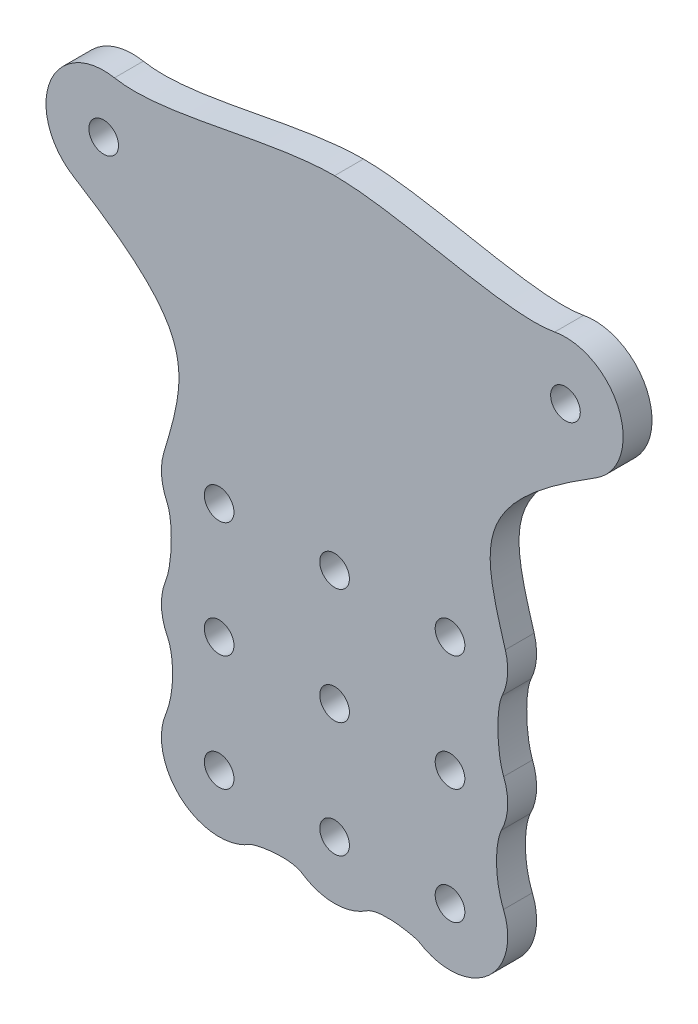
ISO-10303-21;
HEADER;
FILE_DESCRIPTION(('STEP AP214'),'2;1');
FILE_NAME('part.step','',(''),(''),'','','');
FILE_SCHEMA(('AUTOMOTIVE_DESIGN { 1 0 10303 214 1 1 1 1 }'));
ENDSEC;
DATA;
#1=APPLICATION_CONTEXT('core data for automotive mechanical design processes');
#2=APPLICATION_PROTOCOL_DEFINITION('international standard','automotive_design',2000,#1);
#3=PRODUCT_CONTEXT('',#1,'mechanical');
#4=PRODUCT('Part','Part','',(#3));
#5=PRODUCT_RELATED_PRODUCT_CATEGORY('part','',(#4));
#6=PRODUCT_DEFINITION_FORMATION('','',#4);
#7=PRODUCT_DEFINITION_CONTEXT('part definition',#1,'design');
#8=PRODUCT_DEFINITION('design','',#6,#7);
#9=PRODUCT_DEFINITION_SHAPE('','',#8);
#10=(LENGTH_UNIT() NAMED_UNIT(*) SI_UNIT(.MILLI.,.METRE.));
#11=(NAMED_UNIT(*) PLANE_ANGLE_UNIT() SI_UNIT($,.RADIAN.));
#12=(NAMED_UNIT(*) SI_UNIT($,.STERADIAN.) SOLID_ANGLE_UNIT());
#13=UNCERTAINTY_MEASURE_WITH_UNIT(LENGTH_MEASURE(1.E-05),#10,'distance_accuracy_value','');
#14=(GEOMETRIC_REPRESENTATION_CONTEXT(3) GLOBAL_UNCERTAINTY_ASSIGNED_CONTEXT((#13)) GLOBAL_UNIT_ASSIGNED_CONTEXT((#10,
#11,#12)) REPRESENTATION_CONTEXT('',''));
#15=CARTESIAN_POINT('',(0.,0.,0.));
#16=DIRECTION('',(0.,0.,1.));
#17=DIRECTION('',(1.,0.,0.));
#18=AXIS2_PLACEMENT_3D('',#15,#16,#17);
#19=CARTESIAN_POINT('',(57.4738024294832,-10.8051081036806,6.35));
#20=CARTESIAN_POINT('',(30.3242250838508,-27.5741134213604,6.35));
#21=CARTESIAN_POINT('',(32.0432983335942,-35.0407795292835,6.35));
#22=CARTESIAN_POINT('',(37.5674500564816,-53.5108848433959,6.35));
#23=B_SPLINE_CURVE_WITH_KNOTS('',3,(#19,#20,#21,#22),.UNSPECIFIED.,.F.,.F.,(4,4),(0.,1.),.UNSPECIFIED.);
#24=DIRECTION('',(0.,0.,-1.));
#25=VECTOR('',#24,1.);
#26=SURFACE_OF_LINEAR_EXTRUSION('',#23,#25);
#27=CARTESIAN_POINT('',(57.4738024294832,-10.8051081036806,0.));
#28=CARTESIAN_POINT('',(30.3242250838508,-27.5741134213604,0.));
#29=CARTESIAN_POINT('',(32.0432983335942,-35.0407795292835,0.));
#30=CARTESIAN_POINT('',(37.5674500564816,-53.5108848433959,0.));
#31=B_SPLINE_CURVE_WITH_KNOTS('',3,(#27,#28,#29,#30),.UNSPECIFIED.,.F.,.F.,(4,4),(0.,1.),.UNSPECIFIED.);
#32=CARTESIAN_POINT('',(57.4738024294832,-10.8051081036806,0.));
#33=VERTEX_POINT('',#32);
#34=CARTESIAN_POINT('',(37.5674500564818,-53.5108848433959,0.));
#35=VERTEX_POINT('',#34);
#36=EDGE_CURVE('E376',#33,#35,#31,.T.);
#37=ORIENTED_EDGE('',*,*,#36,.F.);
#38=DIRECTION('',(0.,0.,-1.));
#39=VECTOR('',#38,1.);
#40=CARTESIAN_POINT('',(57.4738024294832,-10.8051081036806,6.35));
#41=LINE('',#40,#39);
#42=CARTESIAN_POINT('',(57.4738024294832,-10.8051081036806,6.35));
#43=VERTEX_POINT('',#42);
#44=EDGE_CURVE('E11',#43,#33,#41,.T.);
#45=ORIENTED_EDGE('',*,*,#44,.F.);
#46=CARTESIAN_POINT('',(37.5674500564818,-53.5108848433959,6.35));
#47=VERTEX_POINT('',#46);
#48=EDGE_CURVE('E346',#43,#47,#23,.T.);
#49=ORIENTED_EDGE('',*,*,#48,.T.);
#50=DIRECTION('',(0.,0.,-1.));
#51=VECTOR('',#50,1.);
#52=CARTESIAN_POINT('',(37.5674500564818,-53.5108848433959,6.35));
#53=LINE('',#52,#51);
#54=EDGE_CURVE('E119',#47,#35,#53,.T.);
#55=ORIENTED_EDGE('',*,*,#54,.T.);
#56=EDGE_LOOP('',(#37,#45,#49,#55));
#57=FACE_BOUND('',#56,.T.);
#58=ADVANCED_FACE('F35',(#57),#26,.T.);
#59=CARTESIAN_POINT('',(50.8,0.,6.35));
#60=DIRECTION('',(0.,0.,-1.));
#61=DIRECTION('',(-1.,0.,0.));
#62=AXIS2_PLACEMENT_3D('',#59,#60,#61);
#63=CYLINDRICAL_SURFACE('',#62,12.7);
#64=CARTESIAN_POINT('',(50.8,0.,0.));
#65=DIRECTION('',(0.,0.,1.));
#66=DIRECTION('',(1.,0.,0.));
#67=AXIS2_PLACEMENT_3D('',#64,#65,#66);
#68=CIRCLE('',#67,12.7);
#69=CARTESIAN_POINT('',(48.4306241439164,12.4770212010963,0.));
#70=VERTEX_POINT('',#69);
#71=EDGE_CURVE('E380',#33,#70,#68,.T.);
#72=ORIENTED_EDGE('',*,*,#71,.T.);
#73=DIRECTION('',(0.,0.,-1.));
#74=VECTOR('',#73,1.);
#75=CARTESIAN_POINT('',(48.4306241439164,12.4770212010963,6.35));
#76=LINE('',#75,#74);
#77=CARTESIAN_POINT('',(48.4306241439164,12.4770212010963,6.35));
#78=VERTEX_POINT('',#77);
#79=EDGE_CURVE('E44',#78,#70,#76,.T.);
#80=ORIENTED_EDGE('',*,*,#79,.F.);
#81=CARTESIAN_POINT('',(50.8,0.,6.35));
#82=DIRECTION('',(0.,0.,1.));
#83=DIRECTION('',(1.,0.,0.));
#84=AXIS2_PLACEMENT_3D('',#81,#82,#83);
#85=CIRCLE('',#84,12.7);
#86=EDGE_CURVE('E340',#43,#78,#85,.T.);
#87=ORIENTED_EDGE('',*,*,#86,.F.);
#88=ORIENTED_EDGE('',*,*,#44,.T.);
#89=EDGE_LOOP('',(#72,#80,#87,#88));
#90=FACE_BOUND('',#89,.T.);
#91=ADVANCED_FACE('F358',(#90),#63,.T.);
#92=CARTESIAN_POINT('',(48.4306241439164,12.4770212010964,6.35));
#93=CARTESIAN_POINT('',(37.3571522113736,10.3741781733325,6.35));
#94=CARTESIAN_POINT('',(14.9650042259532,18.0474494289977,6.35));
#95=CARTESIAN_POINT('',(0.,18.0474494289977,6.35));
#96=B_SPLINE_CURVE_WITH_KNOTS('',3,(#92,#93,#94,#95),.UNSPECIFIED.,.F.,.F.,(4,4),(0.,1.),.UNSPECIFIED.);
#97=DIRECTION('',(0.,0.,-1.));
#98=VECTOR('',#97,1.);
#99=SURFACE_OF_LINEAR_EXTRUSION('',#96,#98);
#100=CARTESIAN_POINT('',(48.4306241439164,12.4770212010964,0.));
#101=CARTESIAN_POINT('',(37.3571522113736,10.3741781733325,0.));
#102=CARTESIAN_POINT('',(14.9650042259532,18.0474494289977,0.));
#103=CARTESIAN_POINT('',(0.,18.0474494289977,0.));
#104=B_SPLINE_CURVE_WITH_KNOTS('',3,(#100,#101,#102,#103),.UNSPECIFIED.,.F.,.F.,(4,4),(0.,1.),.UNSPECIFIED.);
#105=CARTESIAN_POINT('',(0.,18.0474494289977,0.));
#106=VERTEX_POINT('',#105);
#107=EDGE_CURVE('E393',#70,#106,#104,.T.);
#108=ORIENTED_EDGE('',*,*,#107,.T.);
#109=DIRECTION('',(0.,0.,-1.));
#110=VECTOR('',#109,1.);
#111=CARTESIAN_POINT('',(0.,18.0474494289977,6.35));
#112=LINE('',#111,#110);
#113=CARTESIAN_POINT('',(0.,18.0474494289977,6.35));
#114=VERTEX_POINT('',#113);
#115=EDGE_CURVE('E549',#114,#106,#112,.T.);
#116=ORIENTED_EDGE('',*,*,#115,.F.);
#117=EDGE_CURVE('E332',#78,#114,#96,.T.);
#118=ORIENTED_EDGE('',*,*,#117,.F.);
#119=ORIENTED_EDGE('',*,*,#79,.T.);
#120=EDGE_LOOP('',(#108,#116,#118,#119));
#121=FACE_BOUND('',#120,.T.);
#122=ADVANCED_FACE('F323',(#121),#99,.F.);
#123=CARTESIAN_POINT('',(-48.4306241439164,12.4770212010964,6.35));
#124=CARTESIAN_POINT('',(-37.3571522113735,10.3741781733325,6.35));
#125=CARTESIAN_POINT('',(-14.9650042259532,18.0474494289977,6.35));
#126=CARTESIAN_POINT('',(0.,18.0474494289977,6.35));
#127=B_SPLINE_CURVE_WITH_KNOTS('',3,(#123,#124,#125,#126),.UNSPECIFIED.,.F.,.F.,(4,4),(0.,1.),.UNSPECIFIED.);
#128=DIRECTION('',(0.,0.,-1.));
#129=VECTOR('',#128,1.);
#130=SURFACE_OF_LINEAR_EXTRUSION('',#127,#129);
#131=CARTESIAN_POINT('',(-48.4306241439164,12.4770212010964,0.));
#132=CARTESIAN_POINT('',(-37.3571522113735,10.3741781733325,0.));
#133=CARTESIAN_POINT('',(-14.9650042259532,18.0474494289977,0.));
#134=CARTESIAN_POINT('',(0.,18.0474494289977,0.));
#135=B_SPLINE_CURVE_WITH_KNOTS('',3,(#131,#132,#133,#134),.UNSPECIFIED.,.F.,.F.,(4,4),(0.,1.),.UNSPECIFIED.);
#136=CARTESIAN_POINT('',(-48.4306241439164,12.4770212010963,0.));
#137=VERTEX_POINT('',#136);
#138=EDGE_CURVE('E398',#137,#106,#135,.T.);
#139=ORIENTED_EDGE('',*,*,#138,.F.);
#140=DIRECTION('',(0.,0.,-1.));
#141=VECTOR('',#140,1.);
#142=CARTESIAN_POINT('',(-48.4306241439164,12.4770212010963,6.35));
#143=LINE('',#142,#141);
#144=CARTESIAN_POINT('',(-48.4306241439164,12.4770212010963,6.35));
#145=VERTEX_POINT('',#144);
#146=EDGE_CURVE('E547',#145,#137,#143,.T.);
#147=ORIENTED_EDGE('',*,*,#146,.F.);
#148=EDGE_CURVE('E327',#145,#114,#127,.T.);
#149=ORIENTED_EDGE('',*,*,#148,.T.);
#150=ORIENTED_EDGE('',*,*,#115,.T.);
#151=EDGE_LOOP('',(#139,#147,#149,#150));
#152=FACE_BOUND('',#151,.T.);
#153=ADVANCED_FACE('F319',(#152),#130,.T.);
#154=CARTESIAN_POINT('',(-50.8,0.,6.35));
#155=DIRECTION('',(0.,0.,-1.));
#156=DIRECTION('',(-1.,0.,0.));
#157=AXIS2_PLACEMENT_3D('',#154,#155,#156);
#158=CYLINDRICAL_SURFACE('',#157,12.7);
#159=CARTESIAN_POINT('',(-50.8,0.,0.));
#160=DIRECTION('',(0.,0.,1.));
#161=DIRECTION('',(1.,0.,0.));
#162=AXIS2_PLACEMENT_3D('',#159,#160,#161);
#163=CIRCLE('',#162,12.7);
#164=CARTESIAN_POINT('',(-57.4738024294832,-10.8051081036806,0.));
#165=VERTEX_POINT('',#164);
#166=EDGE_CURVE('E406',#137,#165,#163,.T.);
#167=ORIENTED_EDGE('',*,*,#166,.T.);
#168=DIRECTION('',(0.,0.,-1.));
#169=VECTOR('',#168,1.);
#170=CARTESIAN_POINT('',(-57.4738024294832,-10.8051081036806,6.35));
#171=LINE('',#170,#169);
#172=CARTESIAN_POINT('',(-57.4738024294832,-10.8051081036806,6.35));
#173=VERTEX_POINT('',#172);
#174=EDGE_CURVE('E544',#173,#165,#171,.T.);
#175=ORIENTED_EDGE('',*,*,#174,.F.);
#176=CARTESIAN_POINT('',(-50.8,0.,6.35));
#177=DIRECTION('',(0.,0.,1.));
#178=DIRECTION('',(1.,0.,0.));
#179=AXIS2_PLACEMENT_3D('',#176,#177,#178);
#180=CIRCLE('',#179,12.7);
#181=EDGE_CURVE('E307',#145,#173,#180,.T.);
#182=ORIENTED_EDGE('',*,*,#181,.F.);
#183=ORIENTED_EDGE('',*,*,#146,.T.);
#184=EDGE_LOOP('',(#167,#175,#182,#183));
#185=FACE_BOUND('',#184,.T.);
#186=ADVANCED_FACE('F315',(#185),#158,.T.);
#187=CARTESIAN_POINT('',(-57.4738024294832,-10.8051081036806,6.35));
#188=CARTESIAN_POINT('',(-30.3242250838508,-27.5741134213604,6.35));
#189=CARTESIAN_POINT('',(-32.0432983335942,-35.0407795292835,6.35));
#190=CARTESIAN_POINT('',(-37.5674500564816,-53.5108848433959,6.35));
#191=B_SPLINE_CURVE_WITH_KNOTS('',3,(#187,#188,#189,#190),.UNSPECIFIED.,.F.,.F.,(4,4),(0.,1.),.UNSPECIFIED.);
#192=DIRECTION('',(0.,0.,-1.));
#193=VECTOR('',#192,1.);
#194=SURFACE_OF_LINEAR_EXTRUSION('',#191,#193);
#195=CARTESIAN_POINT('',(-57.4738024294832,-10.8051081036806,0.));
#196=CARTESIAN_POINT('',(-30.3242250838508,-27.5741134213604,0.));
#197=CARTESIAN_POINT('',(-32.0432983335942,-35.0407795292835,0.));
#198=CARTESIAN_POINT('',(-37.5674500564816,-53.5108848433959,0.));
#199=B_SPLINE_CURVE_WITH_KNOTS('',3,(#195,#196,#197,#198),.UNSPECIFIED.,.F.,.F.,(4,4),(0.,1.),.UNSPECIFIED.);
#200=CARTESIAN_POINT('',(-37.5674500564816,-53.5108848433959,0.));
#201=VERTEX_POINT('',#200);
#202=EDGE_CURVE('E412',#165,#201,#199,.T.);
#203=ORIENTED_EDGE('',*,*,#202,.T.);
#204=DIRECTION('',(0.,0.,-1.));
#205=VECTOR('',#204,1.);
#206=CARTESIAN_POINT('',(-37.5674500564816,-53.5108848433959,6.35));
#207=LINE('',#206,#205);
#208=CARTESIAN_POINT('',(-37.5674500564816,-53.5108848433959,6.35));
#209=VERTEX_POINT('',#208);
#210=EDGE_CURVE('E541',#209,#201,#207,.T.);
#211=ORIENTED_EDGE('',*,*,#210,.F.);
#212=EDGE_CURVE('E301',#173,#209,#191,.T.);
#213=ORIENTED_EDGE('',*,*,#212,.F.);
#214=ORIENTED_EDGE('',*,*,#174,.T.);
#215=EDGE_LOOP('',(#203,#211,#213,#214));
#216=FACE_BOUND('',#215,.T.);
#217=ADVANCED_FACE('F312',(#216),#194,.F.);
#218=CARTESIAN_POINT('',(-25.4,-57.15,6.35));
#219=DIRECTION('',(0.,0.,-1.));
#220=DIRECTION('',(-1.,0.,0.));
#221=AXIS2_PLACEMENT_3D('',#218,#219,#220);
#222=CYLINDRICAL_SURFACE('',#221,12.7);
#223=CARTESIAN_POINT('',(-25.4,-57.15,0.));
#224=DIRECTION('',(0.,0.,1.));
#225=DIRECTION('',(1.,0.,0.));
#226=AXIS2_PLACEMENT_3D('',#223,#224,#225);
#227=CIRCLE('',#226,12.7);
#228=CARTESIAN_POINT('',(-36.8849332845277,-62.5709138943491,0.));
#229=VERTEX_POINT('',#228);
#230=EDGE_CURVE('E417',#201,#229,#227,.T.);
#231=ORIENTED_EDGE('',*,*,#230,.T.);
#232=DIRECTION('',(0.,0.,-1.));
#233=VECTOR('',#232,1.);
#234=CARTESIAN_POINT('',(-36.8849332845277,-62.5709138943491,6.35));
#235=LINE('',#234,#233);
#236=CARTESIAN_POINT('',(-36.8849332845277,-62.5709138943491,6.35));
#237=VERTEX_POINT('',#236);
#238=EDGE_CURVE('E538',#237,#229,#235,.T.);
#239=ORIENTED_EDGE('',*,*,#238,.F.);
#240=CARTESIAN_POINT('',(-25.4,-57.15,6.35));
#241=DIRECTION('',(0.,0.,1.));
#242=DIRECTION('',(1.,0.,0.));
#243=AXIS2_PLACEMENT_3D('',#240,#241,#242);
#244=CIRCLE('',#243,12.7);
#245=EDGE_CURVE('E295',#209,#237,#244,.T.);
#246=ORIENTED_EDGE('',*,*,#245,.F.);
#247=ORIENTED_EDGE('',*,*,#210,.T.);
#248=EDGE_LOOP('',(#231,#239,#246,#247));
#249=FACE_BOUND('',#248,.T.);
#250=ADVANCED_FACE('F286',(#249),#222,.T.);
#251=CARTESIAN_POINT('',(-36.8849332845277,-62.5709138943491,6.35));
#252=CARTESIAN_POINT('',(-35.4749956987609,-65.5580558086968,6.35));
#253=CARTESIAN_POINT('',(-35.6673472644302,-73.9998796307796,6.35));
#254=CARTESIAN_POINT('',(-37.2012348774644,-77.8573615772252,6.35));
#255=B_SPLINE_CURVE_WITH_KNOTS('',3,(#251,#252,#253,#254),.UNSPECIFIED.,.F.,.F.,(4,4),(0.,1.),.UNSPECIFIED.);
#256=DIRECTION('',(0.,0.,-1.));
#257=VECTOR('',#256,1.);
#258=SURFACE_OF_LINEAR_EXTRUSION('',#255,#257);
#259=CARTESIAN_POINT('',(-36.8849332845277,-62.5709138943491,0.));
#260=CARTESIAN_POINT('',(-35.4749956987609,-65.5580558086968,0.));
#261=CARTESIAN_POINT('',(-35.6673472644302,-73.9998796307796,0.));
#262=CARTESIAN_POINT('',(-37.2012348774644,-77.8573615772252,0.));
#263=B_SPLINE_CURVE_WITH_KNOTS('',3,(#259,#260,#261,#262),.UNSPECIFIED.,.F.,.F.,(4,4),(0.,1.),.UNSPECIFIED.);
#264=CARTESIAN_POINT('',(-37.2012348774644,-77.8573615772252,0.));
#265=VERTEX_POINT('',#264);
#266=EDGE_CURVE('E423',#229,#265,#263,.T.);
#267=ORIENTED_EDGE('',*,*,#266,.T.);
#268=DIRECTION('',(0.,0.,-1.));
#269=VECTOR('',#268,1.);
#270=CARTESIAN_POINT('',(-37.2012348774644,-77.8573615772252,6.35));
#271=LINE('',#270,#269);
#272=CARTESIAN_POINT('',(-37.2012348774644,-77.8573615772252,6.35));
#273=VERTEX_POINT('',#272);
#274=EDGE_CURVE('E535',#273,#265,#271,.T.);
#275=ORIENTED_EDGE('',*,*,#274,.F.);
#276=EDGE_CURVE('E289',#237,#273,#255,.T.);
#277=ORIENTED_EDGE('',*,*,#276,.F.);
#278=ORIENTED_EDGE('',*,*,#238,.T.);
#279=EDGE_LOOP('',(#267,#275,#277,#278));
#280=FACE_BOUND('',#279,.T.);
#281=ADVANCED_FACE('F282',(#280),#258,.F.);
#282=CARTESIAN_POINT('',(-25.3999999999994,-82.55,6.35));
#283=DIRECTION('',(0.,0.,-1.));
#284=DIRECTION('',(-1.,0.,0.));
#285=AXIS2_PLACEMENT_3D('',#282,#283,#284);
#286=CYLINDRICAL_SURFACE('',#285,12.7);
#287=CARTESIAN_POINT('',(-25.3999999999994,-82.55,0.));
#288=DIRECTION('',(0.,0.,1.));
#289=DIRECTION('',(1.,0.,0.));
#290=AXIS2_PLACEMENT_3D('',#287,#288,#289);
#291=CIRCLE('',#290,12.7);
#292=CARTESIAN_POINT('',(-36.7309646466552,-88.285785924896,0.));
#293=VERTEX_POINT('',#292);
#294=EDGE_CURVE('E428',#265,#293,#291,.T.);
#295=ORIENTED_EDGE('',*,*,#294,.T.);
#296=DIRECTION('',(0.,0.,-1.));
#297=VECTOR('',#296,1.);
#298=CARTESIAN_POINT('',(-36.7309646466552,-88.285785924896,6.35));
#299=LINE('',#298,#297);
#300=CARTESIAN_POINT('',(-36.7309646466552,-88.285785924896,6.35));
#301=VERTEX_POINT('',#300);
#302=EDGE_CURVE('E532',#301,#293,#299,.T.);
#303=ORIENTED_EDGE('',*,*,#302,.F.);
#304=CARTESIAN_POINT('',(-25.3999999999994,-82.55,6.35));
#305=DIRECTION('',(0.,0.,1.));
#306=DIRECTION('',(1.,0.,0.));
#307=AXIS2_PLACEMENT_3D('',#304,#305,#306);
#308=CIRCLE('',#307,12.7);
#309=EDGE_CURVE('E270',#273,#301,#308,.T.);
#310=ORIENTED_EDGE('',*,*,#309,.F.);
#311=ORIENTED_EDGE('',*,*,#274,.T.);
#312=EDGE_LOOP('',(#295,#303,#310,#311));
#313=FACE_BOUND('',#312,.T.);
#314=ADVANCED_FACE('F278',(#313),#286,.T.);
#315=CARTESIAN_POINT('',(-36.7309646466552,-88.285785924896,6.35));
#316=CARTESIAN_POINT('',(-35.5295402163297,-90.6591830362768,6.35));
#317=CARTESIAN_POINT('',(-34.868854282622,-97.4912275687183,6.35));
#318=CARTESIAN_POINT('',(-37.1731395372377,-103.187313212408,6.35));
#319=B_SPLINE_CURVE_WITH_KNOTS('',3,(#315,#316,#317,#318),.UNSPECIFIED.,.F.,.F.,(4,4),(0.,1.),.UNSPECIFIED.);
#320=DIRECTION('',(0.,0.,-1.));
#321=VECTOR('',#320,1.);
#322=SURFACE_OF_LINEAR_EXTRUSION('',#319,#321);
#323=CARTESIAN_POINT('',(-36.7309646466552,-88.285785924896,0.));
#324=CARTESIAN_POINT('',(-35.5295402163297,-90.6591830362768,0.));
#325=CARTESIAN_POINT('',(-34.868854282622,-97.4912275687183,0.));
#326=CARTESIAN_POINT('',(-37.1731395372377,-103.187313212408,0.));
#327=B_SPLINE_CURVE_WITH_KNOTS('',3,(#323,#324,#325,#326),.UNSPECIFIED.,.F.,.F.,(4,4),(0.,1.),.UNSPECIFIED.);
#328=CARTESIAN_POINT('',(-37.1731395372377,-103.187313212408,0.));
#329=VERTEX_POINT('',#328);
#330=EDGE_CURVE('E434',#293,#329,#327,.T.);
#331=ORIENTED_EDGE('',*,*,#330,.T.);
#332=DIRECTION('',(0.,0.,-1.));
#333=VECTOR('',#332,1.);
#334=CARTESIAN_POINT('',(-37.1731395372377,-103.187313212408,6.35));
#335=LINE('',#334,#333);
#336=CARTESIAN_POINT('',(-37.1731395372377,-103.187313212408,6.35));
#337=VERTEX_POINT('',#336);
#338=EDGE_CURVE('E529',#337,#329,#335,.T.);
#339=ORIENTED_EDGE('',*,*,#338,.F.);
#340=EDGE_CURVE('E264',#301,#337,#319,.T.);
#341=ORIENTED_EDGE('',*,*,#340,.F.);
#342=ORIENTED_EDGE('',*,*,#302,.T.);
#343=EDGE_LOOP('',(#331,#339,#341,#342));
#344=FACE_BOUND('',#343,.T.);
#345=ADVANCED_FACE('F275',(#344),#322,.F.);
#346=CARTESIAN_POINT('',(-25.3999999999987,-107.95,6.35));
#347=DIRECTION('',(0.,0.,-1.));
#348=DIRECTION('',(-1.,0.,0.));
#349=AXIS2_PLACEMENT_3D('',#346,#347,#348);
#350=CYLINDRICAL_SURFACE('',#349,12.7);
#351=CARTESIAN_POINT('',(-25.3999999999987,-107.95,0.));
#352=DIRECTION('',(0.,0.,1.));
#353=DIRECTION('',(1.,0.,0.));
#354=AXIS2_PLACEMENT_3D('',#351,#352,#353);
#355=CIRCLE('',#354,12.7);
#356=CARTESIAN_POINT('',(-18.5053222105921,-118.615524749409,0.));
#357=VERTEX_POINT('',#356);
#358=EDGE_CURVE('E439',#329,#357,#355,.T.);
#359=ORIENTED_EDGE('',*,*,#358,.T.);
#360=DIRECTION('',(0.,0.,-1.));
#361=VECTOR('',#360,1.);
#362=CARTESIAN_POINT('',(-18.5053222105921,-118.615524749409,6.35));
#363=LINE('',#362,#361);
#364=CARTESIAN_POINT('',(-18.5053222105921,-118.615524749409,6.35));
#365=VERTEX_POINT('',#364);
#366=EDGE_CURVE('E526',#365,#357,#363,.T.);
#367=ORIENTED_EDGE('',*,*,#366,.F.);
#368=CARTESIAN_POINT('',(-25.3999999999987,-107.95,6.35));
#369=DIRECTION('',(0.,0.,1.));
#370=DIRECTION('',(1.,0.,0.));
#371=AXIS2_PLACEMENT_3D('',#368,#369,#370);
#372=CIRCLE('',#371,12.7);
#373=EDGE_CURVE('E258',#337,#365,#372,.T.);
#374=ORIENTED_EDGE('',*,*,#373,.F.);
#375=ORIENTED_EDGE('',*,*,#338,.T.);
#376=EDGE_LOOP('',(#359,#367,#374,#375));
#377=FACE_BOUND('',#376,.T.);
#378=ADVANCED_FACE('F249',(#377),#350,.T.);
#379=CARTESIAN_POINT('',(-18.5053222105921,-118.615524749409,6.35));
#380=CARTESIAN_POINT('',(-17.9417143904269,-118.251183152448,6.35));
#381=CARTESIAN_POINT('',(-10.1845815640833,-116.425254559824,6.35));
#382=CARTESIAN_POINT('',(-7.04125617218424,-118.519328811124,6.35));
#383=B_SPLINE_CURVE_WITH_KNOTS('',3,(#379,#380,#381,#382),.UNSPECIFIED.,.F.,.F.,(4,4),(0.,1.),.UNSPECIFIED.);
#384=DIRECTION('',(0.,0.,-1.));
#385=VECTOR('',#384,1.);
#386=SURFACE_OF_LINEAR_EXTRUSION('',#383,#385);
#387=CARTESIAN_POINT('',(-18.5053222105921,-118.615524749409,0.));
#388=CARTESIAN_POINT('',(-17.9417143904269,-118.251183152448,0.));
#389=CARTESIAN_POINT('',(-10.1845815640833,-116.425254559824,0.));
#390=CARTESIAN_POINT('',(-7.04125617218424,-118.519328811124,0.));
#391=B_SPLINE_CURVE_WITH_KNOTS('',3,(#387,#388,#389,#390),.UNSPECIFIED.,.F.,.F.,(4,4),(0.,1.),.UNSPECIFIED.);
#392=CARTESIAN_POINT('',(-7.04125617218408,-118.519328811124,0.));
#393=VERTEX_POINT('',#392);
#394=EDGE_CURVE('E445',#357,#393,#391,.T.);
#395=ORIENTED_EDGE('',*,*,#394,.T.);
#396=DIRECTION('',(0.,0.,-1.));
#397=VECTOR('',#396,1.);
#398=CARTESIAN_POINT('',(-7.04125617218408,-118.519328811124,6.35));
#399=LINE('',#398,#397);
#400=CARTESIAN_POINT('',(-7.04125617218408,-118.519328811124,6.35));
#401=VERTEX_POINT('',#400);
#402=EDGE_CURVE('E523',#401,#393,#399,.T.);
#403=ORIENTED_EDGE('',*,*,#402,.F.);
#404=EDGE_CURVE('E252',#365,#401,#383,.T.);
#405=ORIENTED_EDGE('',*,*,#404,.F.);
#406=ORIENTED_EDGE('',*,*,#366,.T.);
#407=EDGE_LOOP('',(#395,#403,#405,#406));
#408=FACE_BOUND('',#407,.T.);
#409=ADVANCED_FACE('F245',(#408),#386,.F.);
#410=CARTESIAN_POINT('',(1.26287869051112E-12,-107.95,6.35));
#411=DIRECTION('',(0.,0.,-1.));
#412=DIRECTION('',(-1.,0.,0.));
#413=AXIS2_PLACEMENT_3D('',#410,#411,#412);
#414=CYLINDRICAL_SURFACE('',#413,12.7);
#415=CARTESIAN_POINT('',(1.26287869051112E-12,-107.95,0.));
#416=DIRECTION('',(0.,0.,1.));
#417=DIRECTION('',(1.,0.,0.));
#418=AXIS2_PLACEMENT_3D('',#415,#416,#417);
#419=CIRCLE('',#418,12.7);
#420=CARTESIAN_POINT('',(7.04125617218486,-118.519328811125,0.));
#421=VERTEX_POINT('',#420);
#422=EDGE_CURVE('E450',#393,#421,#419,.T.);
#423=ORIENTED_EDGE('',*,*,#422,.T.);
#424=DIRECTION('',(0.,0.,-1.));
#425=VECTOR('',#424,1.);
#426=CARTESIAN_POINT('',(7.04125617218486,-118.519328811125,6.35));
#427=LINE('',#426,#425);
#428=CARTESIAN_POINT('',(7.04125617218486,-118.519328811125,6.35));
#429=VERTEX_POINT('',#428);
#430=EDGE_CURVE('E521',#429,#421,#427,.T.);
#431=ORIENTED_EDGE('',*,*,#430,.F.);
#432=CARTESIAN_POINT('',(1.26287869051112E-12,-107.95,6.35));
#433=DIRECTION('',(0.,0.,1.));
#434=DIRECTION('',(1.,0.,0.));
#435=AXIS2_PLACEMENT_3D('',#432,#433,#434);
#436=CIRCLE('',#435,12.7);
#437=EDGE_CURVE('E233',#401,#429,#436,.T.);
#438=ORIENTED_EDGE('',*,*,#437,.F.);
#439=ORIENTED_EDGE('',*,*,#402,.T.);
#440=EDGE_LOOP('',(#423,#431,#438,#439));
#441=FACE_BOUND('',#440,.T.);
#442=ADVANCED_FACE('F241',(#441),#414,.T.);
#443=CARTESIAN_POINT('',(18.5053222105921,-118.615524749409,6.35));
#444=CARTESIAN_POINT('',(17.9417143904269,-118.251183152448,6.35));
#445=CARTESIAN_POINT('',(10.1845815640833,-116.425254559824,6.35));
#446=CARTESIAN_POINT('',(7.04125617218425,-118.519328811124,6.35));
#447=B_SPLINE_CURVE_WITH_KNOTS('',3,(#443,#444,#445,#446),.UNSPECIFIED.,.F.,.F.,(4,4),(0.,1.),.UNSPECIFIED.);
#448=DIRECTION('',(0.,0.,-1.));
#449=VECTOR('',#448,1.);
#450=SURFACE_OF_LINEAR_EXTRUSION('',#447,#449);
#451=CARTESIAN_POINT('',(18.5053222105921,-118.615524749409,0.));
#452=CARTESIAN_POINT('',(17.9417143904269,-118.251183152448,0.));
#453=CARTESIAN_POINT('',(10.1845815640833,-116.425254559824,0.));
#454=CARTESIAN_POINT('',(7.04125617218425,-118.519328811124,0.));
#455=B_SPLINE_CURVE_WITH_KNOTS('',3,(#451,#452,#453,#454),.UNSPECIFIED.,.F.,.F.,(4,4),(0.,1.),.UNSPECIFIED.);
#456=CARTESIAN_POINT('',(18.5053222105932,-118.615524749408,0.));
#457=VERTEX_POINT('',#456);
#458=EDGE_CURVE('E456',#457,#421,#455,.T.);
#459=ORIENTED_EDGE('',*,*,#458,.F.);
#460=DIRECTION('',(0.,0.,-1.));
#461=VECTOR('',#460,1.);
#462=CARTESIAN_POINT('',(18.5053222105932,-118.615524749408,6.35));
#463=LINE('',#462,#461);
#464=CARTESIAN_POINT('',(18.5053222105932,-118.615524749408,6.35));
#465=VERTEX_POINT('',#464);
#466=EDGE_CURVE('E519',#465,#457,#463,.T.);
#467=ORIENTED_EDGE('',*,*,#466,.F.);
#468=EDGE_CURVE('E227',#465,#429,#447,.T.);
#469=ORIENTED_EDGE('',*,*,#468,.T.);
#470=ORIENTED_EDGE('',*,*,#430,.T.);
#471=EDGE_LOOP('',(#459,#467,#469,#470));
#472=FACE_BOUND('',#471,.T.);
#473=ADVANCED_FACE('F238',(#472),#450,.T.);
#474=CARTESIAN_POINT('',(25.4000000000013,-107.949999999999,6.35));
#475=DIRECTION('',(0.,0.,-1.));
#476=DIRECTION('',(-1.,0.,0.));
#477=AXIS2_PLACEMENT_3D('',#474,#475,#476);
#478=CYLINDRICAL_SURFACE('',#477,12.7);
#479=CARTESIAN_POINT('',(25.4000000000013,-107.949999999999,0.));
#480=DIRECTION('',(0.,0.,1.));
#481=DIRECTION('',(1.,0.,0.));
#482=AXIS2_PLACEMENT_3D('',#479,#480,#481);
#483=CIRCLE('',#482,12.7);
#484=CARTESIAN_POINT('',(37.1731395372401,-103.187313212407,0.));
#485=VERTEX_POINT('',#484);
#486=EDGE_CURVE('E461',#457,#485,#483,.T.);
#487=ORIENTED_EDGE('',*,*,#486,.T.);
#488=DIRECTION('',(0.,0.,-1.));
#489=VECTOR('',#488,1.);
#490=CARTESIAN_POINT('',(37.1731395372401,-103.187313212407,6.35));
#491=LINE('',#490,#489);
#492=CARTESIAN_POINT('',(37.1731395372401,-103.187313212407,6.35));
#493=VERTEX_POINT('',#492);
#494=EDGE_CURVE('E517',#493,#485,#491,.T.);
#495=ORIENTED_EDGE('',*,*,#494,.F.);
#496=CARTESIAN_POINT('',(25.4000000000013,-107.949999999999,6.35));
#497=DIRECTION('',(0.,0.,1.));
#498=DIRECTION('',(1.,0.,0.));
#499=AXIS2_PLACEMENT_3D('',#496,#497,#498);
#500=CIRCLE('',#499,12.7);
#501=EDGE_CURVE('E222',#465,#493,#500,.T.);
#502=ORIENTED_EDGE('',*,*,#501,.F.);
#503=ORIENTED_EDGE('',*,*,#466,.T.);
#504=EDGE_LOOP('',(#487,#495,#502,#503));
#505=FACE_BOUND('',#504,.T.);
#506=ADVANCED_FACE('F215',(#505),#478,.T.);
#507=CARTESIAN_POINT('',(36.7309646466552,-88.285785924896,6.35));
#508=CARTESIAN_POINT('',(35.5295402163298,-90.6591830362768,6.35));
#509=CARTESIAN_POINT('',(34.868854282622,-97.4912275687183,6.35));
#510=CARTESIAN_POINT('',(37.1731395372377,-103.187313212408,6.35));
#511=B_SPLINE_CURVE_WITH_KNOTS('',3,(#507,#508,#509,#510),.UNSPECIFIED.,.F.,.F.,(4,4),(0.,1.),.UNSPECIFIED.);
#512=DIRECTION('',(0.,0.,-1.));
#513=VECTOR('',#512,1.);
#514=SURFACE_OF_LINEAR_EXTRUSION('',#511,#513);
#515=CARTESIAN_POINT('',(36.7309646466552,-88.285785924896,0.));
#516=CARTESIAN_POINT('',(35.5295402163298,-90.6591830362768,0.));
#517=CARTESIAN_POINT('',(34.868854282622,-97.4912275687183,0.));
#518=CARTESIAN_POINT('',(37.1731395372377,-103.187313212408,0.));
#519=B_SPLINE_CURVE_WITH_KNOTS('',3,(#515,#516,#517,#518),.UNSPECIFIED.,.F.,.F.,(4,4),(0.,1.),.UNSPECIFIED.);
#520=CARTESIAN_POINT('',(36.730964646656,-88.2857859248964,0.));
#521=VERTEX_POINT('',#520);
#522=EDGE_CURVE('E467',#521,#485,#519,.T.);
#523=ORIENTED_EDGE('',*,*,#522,.F.);
#524=DIRECTION('',(0.,0.,-1.));
#525=VECTOR('',#524,1.);
#526=CARTESIAN_POINT('',(36.730964646656,-88.2857859248964,6.35));
#527=LINE('',#526,#525);
#528=CARTESIAN_POINT('',(36.730964646656,-88.2857859248964,6.35));
#529=VERTEX_POINT('',#528);
#530=EDGE_CURVE('E189',#529,#521,#527,.T.);
#531=ORIENTED_EDGE('',*,*,#530,.F.);
#532=EDGE_CURVE('E178',#529,#493,#511,.T.);
#533=ORIENTED_EDGE('',*,*,#532,.T.);
#534=ORIENTED_EDGE('',*,*,#494,.T.);
#535=EDGE_LOOP('',(#523,#531,#533,#534));
#536=FACE_BOUND('',#535,.T.);
#537=ADVANCED_FACE('F212',(#536),#514,.T.);
#538=CARTESIAN_POINT('',(25.4000000000006,-82.5499999999993,6.35));
#539=DIRECTION('',(0.,0.,-1.));
#540=DIRECTION('',(-1.,0.,0.));
#541=AXIS2_PLACEMENT_3D('',#538,#539,#540);
#542=CYLINDRICAL_SURFACE('',#541,12.7);
#543=CARTESIAN_POINT('',(25.4000000000006,-82.5499999999993,0.));
#544=DIRECTION('',(0.,0.,1.));
#545=DIRECTION('',(1.,0.,0.));
#546=AXIS2_PLACEMENT_3D('',#543,#544,#545);
#547=CIRCLE('',#546,12.7);
#548=CARTESIAN_POINT('',(37.2012348774657,-77.8573615772246,0.));
#549=VERTEX_POINT('',#548);
#550=EDGE_CURVE('E185',#521,#549,#547,.T.);
#551=ORIENTED_EDGE('',*,*,#550,.T.);
#552=DIRECTION('',(0.,0.,-1.));
#553=VECTOR('',#552,1.);
#554=CARTESIAN_POINT('',(37.2012348774657,-77.8573615772246,6.35));
#555=LINE('',#554,#553);
#556=CARTESIAN_POINT('',(37.2012348774657,-77.8573615772246,6.35));
#557=VERTEX_POINT('',#556);
#558=EDGE_CURVE('E182',#557,#549,#555,.T.);
#559=ORIENTED_EDGE('',*,*,#558,.F.);
#560=CARTESIAN_POINT('',(25.4000000000006,-82.5499999999993,6.35));
#561=DIRECTION('',(0.,0.,1.));
#562=DIRECTION('',(1.,0.,0.));
#563=AXIS2_PLACEMENT_3D('',#560,#561,#562);
#564=CIRCLE('',#563,12.7);
#565=EDGE_CURVE('E171',#529,#557,#564,.T.);
#566=ORIENTED_EDGE('',*,*,#565,.F.);
#567=ORIENTED_EDGE('',*,*,#530,.T.);
#568=EDGE_LOOP('',(#551,#559,#566,#567));
#569=FACE_BOUND('',#568,.T.);
#570=ADVANCED_FACE('F183',(#569),#542,.T.);
#571=CARTESIAN_POINT('',(36.8849332845277,-62.5709138943491,6.35));
#572=CARTESIAN_POINT('',(35.4749956987609,-65.5580558086968,6.35));
#573=CARTESIAN_POINT('',(35.6673472644302,-73.9998796307796,6.35));
#574=CARTESIAN_POINT('',(37.2012348774644,-77.8573615772252,6.35));
#575=B_SPLINE_CURVE_WITH_KNOTS('',3,(#571,#572,#573,#574),.UNSPECIFIED.,.F.,.F.,(4,4),(0.,1.),.UNSPECIFIED.);
#576=DIRECTION('',(0.,0.,-1.));
#577=VECTOR('',#576,1.);
#578=SURFACE_OF_LINEAR_EXTRUSION('',#575,#577);
#579=CARTESIAN_POINT('',(36.8849332845277,-62.5709138943491,0.));
#580=CARTESIAN_POINT('',(35.4749956987609,-65.5580558086968,0.));
#581=CARTESIAN_POINT('',(35.6673472644302,-73.9998796307796,0.));
#582=CARTESIAN_POINT('',(37.2012348774644,-77.8573615772252,0.));
#583=B_SPLINE_CURVE_WITH_KNOTS('',3,(#579,#580,#581,#582),.UNSPECIFIED.,.F.,.F.,(4,4),(0.,1.),.UNSPECIFIED.);
#584=CARTESIAN_POINT('',(36.8849332845275,-62.570913894349,0.));
#585=VERTEX_POINT('',#584);
#586=EDGE_CURVE('E476',#585,#549,#583,.T.);
#587=ORIENTED_EDGE('',*,*,#586,.F.);
#588=DIRECTION('',(0.,0.,-1.));
#589=VECTOR('',#588,1.);
#590=CARTESIAN_POINT('',(36.8849332845275,-62.570913894349,6.35));
#591=LINE('',#590,#589);
#592=CARTESIAN_POINT('',(36.8849332845275,-62.570913894349,6.35));
#593=VERTEX_POINT('',#592);
#594=EDGE_CURVE('E112',#593,#585,#591,.T.);
#595=ORIENTED_EDGE('',*,*,#594,.F.);
#596=EDGE_CURVE('E176',#593,#557,#575,.T.);
#597=ORIENTED_EDGE('',*,*,#596,.T.);
#598=ORIENTED_EDGE('',*,*,#558,.T.);
#599=EDGE_LOOP('',(#587,#595,#597,#598));
#600=FACE_BOUND('',#599,.T.);
#601=ADVANCED_FACE('F191',(#600),#578,.T.);
#602=CARTESIAN_POINT('',(-50.8,0.,6.35));
#603=DIRECTION('',(0.,0.,-1.));
#604=DIRECTION('',(-1.,0.,0.));
#605=AXIS2_PLACEMENT_3D('',#602,#603,#604);
#606=CYLINDRICAL_SURFACE('',#605,3.2639);
#607=CARTESIAN_POINT('',(-50.8,0.,6.35));
#608=DIRECTION('',(0.,0.,1.));
#609=DIRECTION('',(1.,0.,0.));
#610=AXIS2_PLACEMENT_3D('',#607,#608,#609);
#611=CIRCLE('',#610,3.2639);
#612=CARTESIAN_POINT('',(-47.5361,0.,6.35));
#613=VERTEX_POINT('',#612);
#614=EDGE_CURVE('E807',#613,#613,#611,.T.);
#615=ORIENTED_EDGE('',*,*,#614,.T.);
#616=EDGE_LOOP('',(#615));
#617=FACE_BOUND('',#616,.T.);
#618=CARTESIAN_POINT('',(-50.8,0.,0.));
#619=DIRECTION('',(0.,0.,1.));
#620=DIRECTION('',(1.,0.,0.));
#621=AXIS2_PLACEMENT_3D('',#618,#619,#620);
#622=CIRCLE('',#621,3.2639);
#623=CARTESIAN_POINT('',(-47.5361,0.,0.));
#624=VERTEX_POINT('',#623);
#625=EDGE_CURVE('E506',#624,#624,#622,.T.);
#626=ORIENTED_EDGE('',*,*,#625,.F.);
#627=EDGE_LOOP('',(#626));
#628=FACE_BOUND('',#627,.T.);
#629=ADVANCED_FACE('F207',(#617,#628),#606,.F.);
#630=CARTESIAN_POINT('',(-25.4,-57.15,6.35));
#631=DIRECTION('',(0.,0.,-1.));
#632=DIRECTION('',(-1.,0.,0.));
#633=AXIS2_PLACEMENT_3D('',#630,#631,#632);
#634=CYLINDRICAL_SURFACE('',#633,3.2639);
#635=CARTESIAN_POINT('',(-25.4,-57.15,6.35));
#636=DIRECTION('',(0.,0.,1.));
#637=DIRECTION('',(1.,0.,0.));
#638=AXIS2_PLACEMENT_3D('',#635,#636,#637);
#639=CIRCLE('',#638,3.2639);
#640=CARTESIAN_POINT('',(-22.1361,-57.15,6.35));
#641=VERTEX_POINT('',#640);
#642=EDGE_CURVE('E809',#641,#641,#639,.T.);
#643=ORIENTED_EDGE('',*,*,#642,.T.);
#644=EDGE_LOOP('',(#643));
#645=FACE_BOUND('',#644,.T.);
#646=CARTESIAN_POINT('',(-25.4,-57.15,0.));
#647=DIRECTION('',(0.,0.,1.));
#648=DIRECTION('',(1.,0.,0.));
#649=AXIS2_PLACEMENT_3D('',#646,#647,#648);
#650=CIRCLE('',#649,3.2639);
#651=CARTESIAN_POINT('',(-22.1361,-57.15,0.));
#652=VERTEX_POINT('',#651);
#653=EDGE_CURVE('E503',#652,#652,#650,.T.);
#654=ORIENTED_EDGE('',*,*,#653,.F.);
#655=EDGE_LOOP('',(#654));
#656=FACE_BOUND('',#655,.T.);
#657=ADVANCED_FACE('F606',(#645,#656),#634,.F.);
#658=CARTESIAN_POINT('',(-25.3999999999994,-82.55,6.35));
#659=DIRECTION('',(0.,0.,-1.));
#660=DIRECTION('',(-1.,0.,0.));
#661=AXIS2_PLACEMENT_3D('',#658,#659,#660);
#662=CYLINDRICAL_SURFACE('',#661,3.2639);
#663=CARTESIAN_POINT('',(-25.3999999999994,-82.55,6.35));
#664=DIRECTION('',(0.,0.,1.));
#665=DIRECTION('',(1.,0.,0.));
#666=AXIS2_PLACEMENT_3D('',#663,#664,#665);
#667=CIRCLE('',#666,3.2639);
#668=CARTESIAN_POINT('',(-22.1360999999994,-82.55,6.35));
#669=VERTEX_POINT('',#668);
#670=EDGE_CURVE('E814',#669,#669,#667,.T.);
#671=ORIENTED_EDGE('',*,*,#670,.T.);
#672=EDGE_LOOP('',(#671));
#673=FACE_BOUND('',#672,.T.);
#674=CARTESIAN_POINT('',(-25.3999999999994,-82.55,0.));
#675=DIRECTION('',(0.,0.,1.));
#676=DIRECTION('',(1.,0.,0.));
#677=AXIS2_PLACEMENT_3D('',#674,#675,#676);
#678=CIRCLE('',#677,3.2639);
#679=CARTESIAN_POINT('',(-22.1360999999994,-82.55,0.));
#680=VERTEX_POINT('',#679);
#681=EDGE_CURVE('E500',#680,#680,#678,.T.);
#682=ORIENTED_EDGE('',*,*,#681,.F.);
#683=EDGE_LOOP('',(#682));
#684=FACE_BOUND('',#683,.T.);
#685=ADVANCED_FACE('F614',(#673,#684),#662,.F.);
#686=CARTESIAN_POINT('',(-25.3999999999987,-107.95,6.35));
#687=DIRECTION('',(0.,0.,-1.));
#688=DIRECTION('',(-1.,0.,0.));
#689=AXIS2_PLACEMENT_3D('',#686,#687,#688);
#690=CYLINDRICAL_SURFACE('',#689,3.2639);
#691=CARTESIAN_POINT('',(-25.3999999999987,-107.95,6.35));
#692=DIRECTION('',(0.,0.,1.));
#693=DIRECTION('',(1.,0.,0.));
#694=AXIS2_PLACEMENT_3D('',#691,#692,#693);
#695=CIRCLE('',#694,3.2639);
#696=CARTESIAN_POINT('',(-22.1360999999987,-107.95,6.35));
#697=VERTEX_POINT('',#696);
#698=EDGE_CURVE('E817',#697,#697,#695,.T.);
#699=ORIENTED_EDGE('',*,*,#698,.T.);
#700=EDGE_LOOP('',(#699));
#701=FACE_BOUND('',#700,.T.);
#702=CARTESIAN_POINT('',(-25.3999999999987,-107.95,0.));
#703=DIRECTION('',(0.,0.,1.));
#704=DIRECTION('',(1.,0.,0.));
#705=AXIS2_PLACEMENT_3D('',#702,#703,#704);
#706=CIRCLE('',#705,3.2639);
#707=CARTESIAN_POINT('',(-22.1360999999987,-107.95,0.));
#708=VERTEX_POINT('',#707);
#709=EDGE_CURVE('E497',#708,#708,#706,.T.);
#710=ORIENTED_EDGE('',*,*,#709,.F.);
#711=EDGE_LOOP('',(#710));
#712=FACE_BOUND('',#711,.T.);
#713=ADVANCED_FACE('F622',(#701,#712),#690,.F.);
#714=CARTESIAN_POINT('',(1.26140742516496E-12,-107.95,6.35));
#715=DIRECTION('',(0.,0.,-1.));
#716=DIRECTION('',(-1.,0.,0.));
#717=AXIS2_PLACEMENT_3D('',#714,#715,#716);
#718=CYLINDRICAL_SURFACE('',#717,3.2639);
#719=CARTESIAN_POINT('',(1.26140742516496E-12,-107.95,6.35));
#720=DIRECTION('',(0.,0.,1.));
#721=DIRECTION('',(1.,0.,0.));
#722=AXIS2_PLACEMENT_3D('',#719,#720,#721);
#723=CIRCLE('',#722,3.2639);
#724=CARTESIAN_POINT('',(3.26390000000126,-107.95,6.35));
#725=VERTEX_POINT('',#724);
#726=EDGE_CURVE('E820',#725,#725,#723,.T.);
#727=ORIENTED_EDGE('',*,*,#726,.T.);
#728=EDGE_LOOP('',(#727));
#729=FACE_BOUND('',#728,.T.);
#730=CARTESIAN_POINT('',(1.26140742516496E-12,-107.95,0.));
#731=DIRECTION('',(0.,0.,1.));
#732=DIRECTION('',(1.,0.,0.));
#733=AXIS2_PLACEMENT_3D('',#730,#731,#732);
#734=CIRCLE('',#733,3.2639);
#735=CARTESIAN_POINT('',(3.26390000000126,-107.95,0.));
#736=VERTEX_POINT('',#735);
#737=EDGE_CURVE('E494',#736,#736,#734,.T.);
#738=ORIENTED_EDGE('',*,*,#737,.F.);
#739=EDGE_LOOP('',(#738));
#740=FACE_BOUND('',#739,.T.);
#741=ADVANCED_FACE('F630',(#729,#740),#718,.F.);
#742=CARTESIAN_POINT('',(25.4000000000013,-107.949999999999,6.35));
#743=DIRECTION('',(0.,0.,-1.));
#744=DIRECTION('',(-1.,0.,0.));
#745=AXIS2_PLACEMENT_3D('',#742,#743,#744);
#746=CYLINDRICAL_SURFACE('',#745,3.2639);
#747=CARTESIAN_POINT('',(25.4000000000013,-107.949999999999,6.35));
#748=DIRECTION('',(0.,0.,1.));
#749=DIRECTION('',(1.,0.,0.));
#750=AXIS2_PLACEMENT_3D('',#747,#748,#749);
#751=CIRCLE('',#750,3.2639);
#752=CARTESIAN_POINT('',(28.6639000000013,-107.949999999999,6.35));
#753=VERTEX_POINT('',#752);
#754=EDGE_CURVE('E823',#753,#753,#751,.T.);
#755=ORIENTED_EDGE('',*,*,#754,.T.);
#756=EDGE_LOOP('',(#755));
#757=FACE_BOUND('',#756,.T.);
#758=CARTESIAN_POINT('',(25.4000000000013,-107.949999999999,0.));
#759=DIRECTION('',(0.,0.,1.));
#760=DIRECTION('',(1.,0.,0.));
#761=AXIS2_PLACEMENT_3D('',#758,#759,#760);
#762=CIRCLE('',#761,3.2639);
#763=CARTESIAN_POINT('',(28.6639000000013,-107.949999999999,0.));
#764=VERTEX_POINT('',#763);
#765=EDGE_CURVE('E491',#764,#764,#762,.T.);
#766=ORIENTED_EDGE('',*,*,#765,.F.);
#767=EDGE_LOOP('',(#766));
#768=FACE_BOUND('',#767,.T.);
#769=ADVANCED_FACE('F638',(#757,#768),#746,.F.);
#770=CARTESIAN_POINT('',(25.4000000000006,-82.5499999999993,6.35));
#771=DIRECTION('',(0.,0.,-1.));
#772=DIRECTION('',(-1.,0.,0.));
#773=AXIS2_PLACEMENT_3D('',#770,#771,#772);
#774=CYLINDRICAL_SURFACE('',#773,3.2639);
#775=CARTESIAN_POINT('',(25.4000000000006,-82.5499999999993,6.35));
#776=DIRECTION('',(0.,0.,1.));
#777=DIRECTION('',(1.,0.,0.));
#778=AXIS2_PLACEMENT_3D('',#775,#776,#777);
#779=CIRCLE('',#778,3.2639);
#780=CARTESIAN_POINT('',(28.6639000000006,-82.5499999999993,6.35));
#781=VERTEX_POINT('',#780);
#782=EDGE_CURVE('E826',#781,#781,#779,.T.);
#783=ORIENTED_EDGE('',*,*,#782,.T.);
#784=EDGE_LOOP('',(#783));
#785=FACE_BOUND('',#784,.T.);
#786=CARTESIAN_POINT('',(25.4000000000006,-82.5499999999993,0.));
#787=DIRECTION('',(0.,0.,1.));
#788=DIRECTION('',(1.,0.,0.));
#789=AXIS2_PLACEMENT_3D('',#786,#787,#788);
#790=CIRCLE('',#789,3.2639);
#791=CARTESIAN_POINT('',(28.6639000000006,-82.5499999999993,0.));
#792=VERTEX_POINT('',#791);
#793=EDGE_CURVE('E488',#792,#792,#790,.T.);
#794=ORIENTED_EDGE('',*,*,#793,.F.);
#795=EDGE_LOOP('',(#794));
#796=FACE_BOUND('',#795,.T.);
#797=ADVANCED_FACE('F646',(#785,#796),#774,.F.);
#798=CARTESIAN_POINT('',(25.4,-57.1499999999993,6.35));
#799=DIRECTION('',(0.,0.,-1.));
#800=DIRECTION('',(-1.,0.,0.));
#801=AXIS2_PLACEMENT_3D('',#798,#799,#800);
#802=CYLINDRICAL_SURFACE('',#801,3.2639);
#803=CARTESIAN_POINT('',(25.4,-57.1499999999993,6.35));
#804=DIRECTION('',(0.,0.,1.));
#805=DIRECTION('',(1.,0.,0.));
#806=AXIS2_PLACEMENT_3D('',#803,#804,#805);
#807=CIRCLE('',#806,3.2639);
#808=CARTESIAN_POINT('',(28.6639,-57.1499999999993,6.35));
#809=VERTEX_POINT('',#808);
#810=EDGE_CURVE('E193',#809,#809,#807,.T.);
#811=ORIENTED_EDGE('',*,*,#810,.T.);
#812=EDGE_LOOP('',(#811));
#813=FACE_BOUND('',#812,.T.);
#814=CARTESIAN_POINT('',(25.4,-57.1499999999993,0.));
#815=DIRECTION('',(0.,0.,1.));
#816=DIRECTION('',(1.,0.,0.));
#817=AXIS2_PLACEMENT_3D('',#814,#815,#816);
#818=CIRCLE('',#817,3.2639);
#819=CARTESIAN_POINT('',(28.6639,-57.1499999999993,0.));
#820=VERTEX_POINT('',#819);
#821=EDGE_CURVE('E485',#820,#820,#818,.T.);
#822=ORIENTED_EDGE('',*,*,#821,.F.);
#823=EDGE_LOOP('',(#822));
#824=FACE_BOUND('',#823,.T.);
#825=ADVANCED_FACE('F368',(#813,#824),#802,.F.);
#826=CARTESIAN_POINT('',(25.4,-57.1499999999993,6.35));
#827=DIRECTION('',(0.,0.,-1.));
#828=DIRECTION('',(-1.,0.,0.));
#829=AXIS2_PLACEMENT_3D('',#826,#827,#828);
#830=CYLINDRICAL_SURFACE('',#829,12.7);
#831=CARTESIAN_POINT('',(25.4,-57.1499999999993,0.));
#832=DIRECTION('',(0.,0.,1.));
#833=DIRECTION('',(1.,0.,0.));
#834=AXIS2_PLACEMENT_3D('',#831,#832,#833);
#835=CIRCLE('',#834,12.7);
#836=EDGE_CURVE('E480',#585,#35,#835,.T.);
#837=ORIENTED_EDGE('',*,*,#836,.T.);
#838=ORIENTED_EDGE('',*,*,#54,.F.);
#839=CARTESIAN_POINT('',(25.4,-57.1499999999993,6.35));
#840=DIRECTION('',(0.,0.,1.));
#841=DIRECTION('',(1.,0.,0.));
#842=AXIS2_PLACEMENT_3D('',#839,#840,#841);
#843=CIRCLE('',#842,12.7);
#844=EDGE_CURVE('E52',#593,#47,#843,.T.);
#845=ORIENTED_EDGE('',*,*,#844,.F.);
#846=ORIENTED_EDGE('',*,*,#594,.T.);
#847=EDGE_LOOP('',(#837,#838,#845,#846));
#848=FACE_BOUND('',#847,.T.);
#849=ADVANCED_FACE('F208',(#848),#830,.T.);
#850=CARTESIAN_POINT('',(6.31439345255558E-13,-82.5499999999997,6.35));
#851=DIRECTION('',(0.,0.,-1.));
#852=DIRECTION('',(-1.,0.,0.));
#853=AXIS2_PLACEMENT_3D('',#850,#851,#852);
#854=CYLINDRICAL_SURFACE('',#853,3.2639);
#855=CARTESIAN_POINT('',(6.31439345255558E-13,-82.5499999999997,6.35));
#856=DIRECTION('',(0.,0.,1.));
#857=DIRECTION('',(1.,0.,0.));
#858=AXIS2_PLACEMENT_3D('',#855,#856,#857);
#859=CIRCLE('',#858,3.2639);
#860=CARTESIAN_POINT('',(3.26390000000063,-82.5499999999997,6.35));
#861=VERTEX_POINT('',#860);
#862=EDGE_CURVE('E351',#861,#861,#859,.T.);
#863=ORIENTED_EDGE('',*,*,#862,.T.);
#864=EDGE_LOOP('',(#863));
#865=FACE_BOUND('',#864,.T.);
#866=CARTESIAN_POINT('',(6.31439345255558E-13,-82.5499999999997,0.));
#867=DIRECTION('',(0.,0.,1.));
#868=DIRECTION('',(1.,0.,0.));
#869=AXIS2_PLACEMENT_3D('',#866,#867,#868);
#870=CIRCLE('',#869,3.2639);
#871=CARTESIAN_POINT('',(3.26390000000063,-82.5499999999997,0.));
#872=VERTEX_POINT('',#871);
#873=EDGE_CURVE('E374',#872,#872,#870,.T.);
#874=ORIENTED_EDGE('',*,*,#873,.F.);
#875=EDGE_LOOP('',(#874));
#876=FACE_BOUND('',#875,.T.);
#877=ADVANCED_FACE('F359',(#865,#876),#854,.F.);
#878=CARTESIAN_POINT('',(0.,-57.15,6.35));
#879=DIRECTION('',(0.,0.,-1.));
#880=DIRECTION('',(-1.,0.,0.));
#881=AXIS2_PLACEMENT_3D('',#878,#879,#880);
#882=CYLINDRICAL_SURFACE('',#881,3.2639);
#883=CARTESIAN_POINT('',(0.,-57.15,6.35));
#884=DIRECTION('',(0.,0.,1.));
#885=DIRECTION('',(1.,0.,0.));
#886=AXIS2_PLACEMENT_3D('',#883,#884,#885);
#887=CIRCLE('',#886,3.2639);
#888=CARTESIAN_POINT('',(3.2639,-57.15,6.35));
#889=VERTEX_POINT('',#888);
#890=EDGE_CURVE('E512',#889,#889,#887,.T.);
#891=ORIENTED_EDGE('',*,*,#890,.T.);
#892=EDGE_LOOP('',(#891));
#893=FACE_BOUND('',#892,.T.);
#894=CARTESIAN_POINT('',(0.,-57.15,0.));
#895=DIRECTION('',(0.,0.,1.));
#896=DIRECTION('',(1.,0.,0.));
#897=AXIS2_PLACEMENT_3D('',#894,#895,#896);
#898=CIRCLE('',#897,3.2639);
#899=CARTESIAN_POINT('',(3.2639,-57.15,0.));
#900=VERTEX_POINT('',#899);
#901=EDGE_CURVE('E377',#900,#900,#898,.T.);
#902=ORIENTED_EDGE('',*,*,#901,.F.);
#903=EDGE_LOOP('',(#902));
#904=FACE_BOUND('',#903,.T.);
#905=ADVANCED_FACE('F37',(#893,#904),#882,.F.);
#906=CARTESIAN_POINT('',(50.8,0.,6.35));
#907=DIRECTION('',(0.,0.,-1.));
#908=DIRECTION('',(-1.,0.,0.));
#909=AXIS2_PLACEMENT_3D('',#906,#907,#908);
#910=CYLINDRICAL_SURFACE('',#909,3.2639);
#911=CARTESIAN_POINT('',(50.8,0.,6.35));
#912=DIRECTION('',(0.,0.,1.));
#913=DIRECTION('',(1.,0.,0.));
#914=AXIS2_PLACEMENT_3D('',#911,#912,#913);
#915=CIRCLE('',#914,3.2639);
#916=CARTESIAN_POINT('',(54.0639,0.,6.35));
#917=VERTEX_POINT('',#916);
#918=EDGE_CURVE('E514',#917,#917,#915,.T.);
#919=ORIENTED_EDGE('',*,*,#918,.T.);
#920=EDGE_LOOP('',(#919));
#921=FACE_BOUND('',#920,.T.);
#922=CARTESIAN_POINT('',(50.8,0.,0.));
#923=DIRECTION('',(0.,0.,1.));
#924=DIRECTION('',(1.,0.,0.));
#925=AXIS2_PLACEMENT_3D('',#922,#923,#924);
#926=CIRCLE('',#925,3.2639);
#927=CARTESIAN_POINT('',(54.0639,0.,0.));
#928=VERTEX_POINT('',#927);
#929=EDGE_CURVE('E509',#928,#928,#926,.T.);
#930=ORIENTED_EDGE('',*,*,#929,.F.);
#931=EDGE_LOOP('',(#930));
#932=FACE_BOUND('',#931,.T.);
#933=ADVANCED_FACE('F366',(#921,#932),#910,.F.);
#934=CARTESIAN_POINT('',(0.,0.,6.35));
#935=DIRECTION('',(0.,0.,1.));
#936=DIRECTION('',(1.,0.,0.));
#937=AXIS2_PLACEMENT_3D('',#934,#935,#936);
#938=PLANE('',#937);
#939=ORIENTED_EDGE('',*,*,#890,.F.);
#940=EDGE_LOOP('',(#939));
#941=FACE_BOUND('',#940,.T.);
#942=ORIENTED_EDGE('',*,*,#862,.F.);
#943=EDGE_LOOP('',(#942));
#944=FACE_BOUND('',#943,.T.);
#945=ORIENTED_EDGE('',*,*,#48,.F.);
#946=ORIENTED_EDGE('',*,*,#86,.T.);
#947=ORIENTED_EDGE('',*,*,#117,.T.);
#948=ORIENTED_EDGE('',*,*,#148,.F.);
#949=ORIENTED_EDGE('',*,*,#181,.T.);
#950=ORIENTED_EDGE('',*,*,#212,.T.);
#951=ORIENTED_EDGE('',*,*,#245,.T.);
#952=ORIENTED_EDGE('',*,*,#276,.T.);
#953=ORIENTED_EDGE('',*,*,#309,.T.);
#954=ORIENTED_EDGE('',*,*,#340,.T.);
#955=ORIENTED_EDGE('',*,*,#373,.T.);
#956=ORIENTED_EDGE('',*,*,#404,.T.);
#957=ORIENTED_EDGE('',*,*,#437,.T.);
#958=ORIENTED_EDGE('',*,*,#468,.F.);
#959=ORIENTED_EDGE('',*,*,#501,.T.);
#960=ORIENTED_EDGE('',*,*,#532,.F.);
#961=ORIENTED_EDGE('',*,*,#565,.T.);
#962=ORIENTED_EDGE('',*,*,#596,.F.);
#963=ORIENTED_EDGE('',*,*,#844,.T.);
#964=EDGE_LOOP('',(#945,#946,#947,#948,#949,#950,#951,#952,#953,#954,#955,#956,#957,#958,#959,
#960,#961,#962,#963));
#965=FACE_BOUND('',#964,.T.);
#966=ORIENTED_EDGE('',*,*,#810,.F.);
#967=EDGE_LOOP('',(#966));
#968=FACE_BOUND('',#967,.T.);
#969=ORIENTED_EDGE('',*,*,#782,.F.);
#970=EDGE_LOOP('',(#969));
#971=FACE_BOUND('',#970,.T.);
#972=ORIENTED_EDGE('',*,*,#754,.F.);
#973=EDGE_LOOP('',(#972));
#974=FACE_BOUND('',#973,.T.);
#975=ORIENTED_EDGE('',*,*,#726,.F.);
#976=EDGE_LOOP('',(#975));
#977=FACE_BOUND('',#976,.T.);
#978=ORIENTED_EDGE('',*,*,#698,.F.);
#979=EDGE_LOOP('',(#978));
#980=FACE_BOUND('',#979,.T.);
#981=ORIENTED_EDGE('',*,*,#670,.F.);
#982=EDGE_LOOP('',(#981));
#983=FACE_BOUND('',#982,.T.);
#984=ORIENTED_EDGE('',*,*,#642,.F.);
#985=EDGE_LOOP('',(#984));
#986=FACE_BOUND('',#985,.T.);
#987=ORIENTED_EDGE('',*,*,#614,.F.);
#988=EDGE_LOOP('',(#987));
#989=FACE_BOUND('',#988,.T.);
#990=ORIENTED_EDGE('',*,*,#918,.F.);
#991=EDGE_LOOP('',(#990));
#992=FACE_BOUND('',#991,.T.);
#993=ADVANCED_FACE('F173',(#941,#944,#965,#968,#971,#974,#977,#980,#983,#986,#989,#992),#938,.T.);
#994=CARTESIAN_POINT('',(0.,0.,0.));
#995=DIRECTION('',(0.,0.,1.));
#996=DIRECTION('',(1.,0.,0.));
#997=AXIS2_PLACEMENT_3D('',#994,#995,#996);
#998=PLANE('',#997);
#999=ORIENTED_EDGE('',*,*,#901,.T.);
#1000=EDGE_LOOP('',(#999));
#1001=FACE_BOUND('',#1000,.T.);
#1002=ORIENTED_EDGE('',*,*,#873,.T.);
#1003=EDGE_LOOP('',(#1002));
#1004=FACE_BOUND('',#1003,.T.);
#1005=ORIENTED_EDGE('',*,*,#36,.T.);
#1006=ORIENTED_EDGE('',*,*,#836,.F.);
#1007=ORIENTED_EDGE('',*,*,#586,.T.);
#1008=ORIENTED_EDGE('',*,*,#550,.F.);
#1009=ORIENTED_EDGE('',*,*,#522,.T.);
#1010=ORIENTED_EDGE('',*,*,#486,.F.);
#1011=ORIENTED_EDGE('',*,*,#458,.T.);
#1012=ORIENTED_EDGE('',*,*,#422,.F.);
#1013=ORIENTED_EDGE('',*,*,#394,.F.);
#1014=ORIENTED_EDGE('',*,*,#358,.F.);
#1015=ORIENTED_EDGE('',*,*,#330,.F.);
#1016=ORIENTED_EDGE('',*,*,#294,.F.);
#1017=ORIENTED_EDGE('',*,*,#266,.F.);
#1018=ORIENTED_EDGE('',*,*,#230,.F.);
#1019=ORIENTED_EDGE('',*,*,#202,.F.);
#1020=ORIENTED_EDGE('',*,*,#166,.F.);
#1021=ORIENTED_EDGE('',*,*,#138,.T.);
#1022=ORIENTED_EDGE('',*,*,#107,.F.);
#1023=ORIENTED_EDGE('',*,*,#71,.F.);
#1024=EDGE_LOOP('',(#1005,#1006,#1007,#1008,#1009,#1010,#1011,#1012,#1013,#1014,#1015,#1016,
#1017,#1018,#1019,#1020,#1021,#1022,#1023));
#1025=FACE_BOUND('',#1024,.T.);
#1026=ORIENTED_EDGE('',*,*,#821,.T.);
#1027=EDGE_LOOP('',(#1026));
#1028=FACE_BOUND('',#1027,.T.);
#1029=ORIENTED_EDGE('',*,*,#793,.T.);
#1030=EDGE_LOOP('',(#1029));
#1031=FACE_BOUND('',#1030,.T.);
#1032=ORIENTED_EDGE('',*,*,#765,.T.);
#1033=EDGE_LOOP('',(#1032));
#1034=FACE_BOUND('',#1033,.T.);
#1035=ORIENTED_EDGE('',*,*,#737,.T.);
#1036=EDGE_LOOP('',(#1035));
#1037=FACE_BOUND('',#1036,.T.);
#1038=ORIENTED_EDGE('',*,*,#709,.T.);
#1039=EDGE_LOOP('',(#1038));
#1040=FACE_BOUND('',#1039,.T.);
#1041=ORIENTED_EDGE('',*,*,#681,.T.);
#1042=EDGE_LOOP('',(#1041));
#1043=FACE_BOUND('',#1042,.T.);
#1044=ORIENTED_EDGE('',*,*,#653,.T.);
#1045=EDGE_LOOP('',(#1044));
#1046=FACE_BOUND('',#1045,.T.);
#1047=ORIENTED_EDGE('',*,*,#625,.T.);
#1048=EDGE_LOOP('',(#1047));
#1049=FACE_BOUND('',#1048,.T.);
#1050=ORIENTED_EDGE('',*,*,#929,.T.);
#1051=EDGE_LOOP('',(#1050));
#1052=FACE_BOUND('',#1051,.T.);
#1053=ADVANCED_FACE('F557',(#1001,#1004,#1025,#1028,#1031,#1034,#1037,#1040,#1043,#1046,#1049,
#1052),#998,.F.);
#1054=CLOSED_SHELL('',(#58,#91,#122,#153,#186,#217,#250,#281,#314,#345,#378,#409,#442,#473,#506,
#537,#570,#601,#629,#657,#685,#713,#741,#769,#797,#825,#849,#877,#905,#933,#993,#1053));
#1055=MANIFOLD_SOLID_BREP('B2',#1054);
#1056=ADVANCED_BREP_SHAPE_REPRESENTATION('',(#18,#1055),#14);
#1057=SHAPE_DEFINITION_REPRESENTATION(#9,#1056);
ENDSEC;
END-ISO-10303-21;
